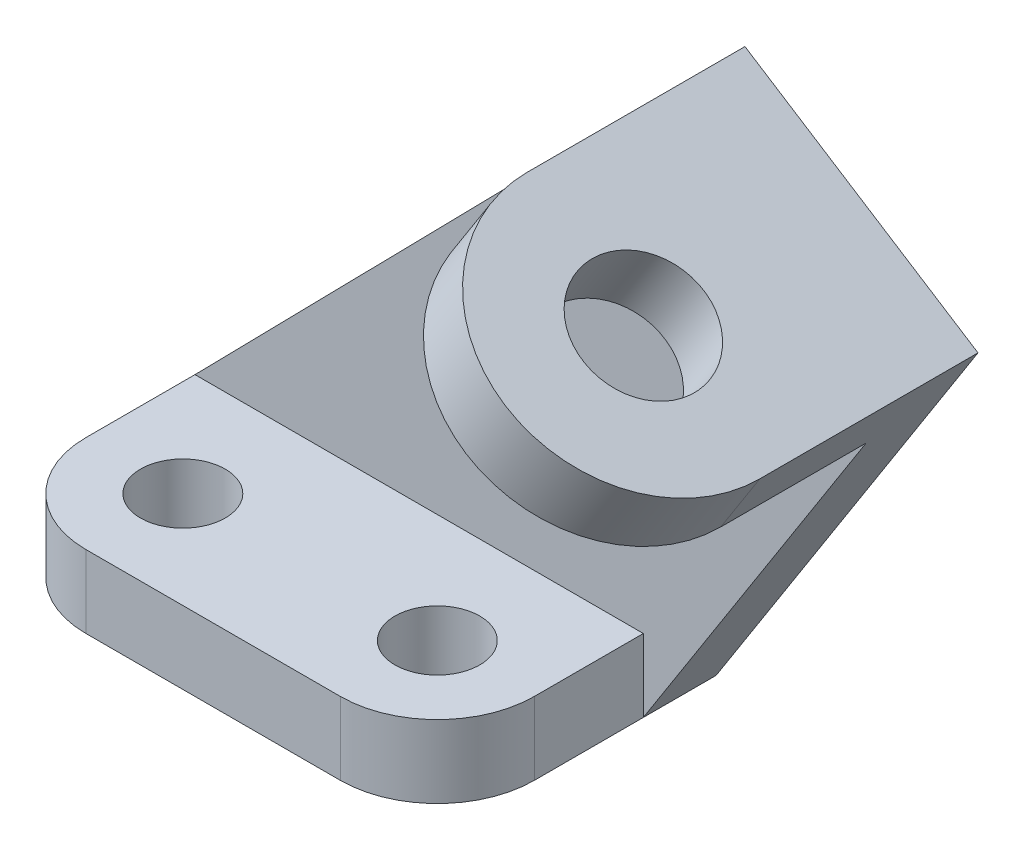
ISO-10303-21;
HEADER;
FILE_DESCRIPTION(('STEP AP214'),'2;1');
FILE_NAME('part.step','',(''),(''),'','','');
FILE_SCHEMA(('AUTOMOTIVE_DESIGN { 1 0 10303 214 1 1 1 1 }'));
ENDSEC;
DATA;
#1=APPLICATION_CONTEXT('core data for automotive mechanical design processes');
#2=APPLICATION_PROTOCOL_DEFINITION('international standard','automotive_design',2000,#1);
#3=PRODUCT_CONTEXT('',#1,'mechanical');
#4=PRODUCT('Part','Part','',(#3));
#5=PRODUCT_RELATED_PRODUCT_CATEGORY('part','',(#4));
#6=PRODUCT_DEFINITION_FORMATION('','',#4);
#7=PRODUCT_DEFINITION_CONTEXT('part definition',#1,'design');
#8=PRODUCT_DEFINITION('design','',#6,#7);
#9=PRODUCT_DEFINITION_SHAPE('','',#8);
#10=(LENGTH_UNIT() NAMED_UNIT(*) SI_UNIT(.MILLI.,.METRE.));
#11=(NAMED_UNIT(*) PLANE_ANGLE_UNIT() SI_UNIT($,.RADIAN.));
#12=(NAMED_UNIT(*) SI_UNIT($,.STERADIAN.) SOLID_ANGLE_UNIT());
#13=UNCERTAINTY_MEASURE_WITH_UNIT(LENGTH_MEASURE(1.E-05),#10,'distance_accuracy_value','');
#14=(GEOMETRIC_REPRESENTATION_CONTEXT(3) GLOBAL_UNCERTAINTY_ASSIGNED_CONTEXT((#13)) GLOBAL_UNIT_ASSIGNED_CONTEXT((#10,
#11,#12)) REPRESENTATION_CONTEXT('',''));
#15=CARTESIAN_POINT('',(0.,0.,0.));
#16=DIRECTION('',(0.,0.,1.));
#17=DIRECTION('',(1.,0.,0.));
#18=AXIS2_PLACEMENT_3D('',#15,#16,#17);
#19=CARTESIAN_POINT('',(16.66875,9.525,23.8125));
#20=DIRECTION('',(0.,-1.,0.));
#21=DIRECTION('',(0.,0.,-1.));
#22=AXIS2_PLACEMENT_3D('',#19,#20,#21);
#23=PLANE('',#22);
#24=CARTESIAN_POINT('',(16.66875,9.525,23.8125));
#25=DIRECTION('',(0.,1.,0.));
#26=DIRECTION('',(0.,0.,-1.));
#27=AXIS2_PLACEMENT_3D('',#24,#25,#26);
#28=CIRCLE('',#27,5.55625);
#29=CARTESIAN_POINT('',(16.66875,9.525,18.25625));
#30=VERTEX_POINT('',#29);
#31=EDGE_CURVE('E184',#30,#30,#28,.T.);
#32=ORIENTED_EDGE('',*,*,#31,.F.);
#33=EDGE_LOOP('',(#32));
#34=FACE_BOUND('',#33,.T.);
#35=CARTESIAN_POINT('',(-16.66875,9.525,23.8125));
#36=DIRECTION('',(0.,1.,0.));
#37=DIRECTION('',(0.,0.,1.));
#38=AXIS2_PLACEMENT_3D('',#35,#36,#37);
#39=CIRCLE('',#38,5.55625);
#40=CARTESIAN_POINT('',(-16.66875,9.525,29.36875));
#41=VERTEX_POINT('',#40);
#42=EDGE_CURVE('E190',#41,#41,#39,.T.);
#43=ORIENTED_EDGE('',*,*,#42,.F.);
#44=EDGE_LOOP('',(#43));
#45=FACE_BOUND('',#44,.T.);
#46=DIRECTION('',(1.,0.,0.));
#47=VECTOR('',#46,1.);
#48=CARTESIAN_POINT('',(16.66875,9.525,9.525));
#49=LINE('',#48,#47);
#50=CARTESIAN_POINT('',(-29.36875,9.525,9.525));
#51=VERTEX_POINT('',#50);
#52=CARTESIAN_POINT('',(29.36875,9.525,9.525));
#53=VERTEX_POINT('',#52);
#54=EDGE_CURVE('E180',#51,#53,#49,.T.);
#55=ORIENTED_EDGE('',*,*,#54,.F.);
#56=DIRECTION('',(0.,0.,1.));
#57=VECTOR('',#56,1.);
#58=CARTESIAN_POINT('',(-29.36875,9.525,0.));
#59=LINE('',#58,#57);
#60=CARTESIAN_POINT('',(-29.36875,9.525,23.8125));
#61=VERTEX_POINT('',#60);
#62=EDGE_CURVE('E202',#51,#61,#59,.T.);
#63=ORIENTED_EDGE('',*,*,#62,.T.);
#64=CARTESIAN_POINT('',(-16.66875,9.525,23.8125));
#65=DIRECTION('',(0.,1.,0.));
#66=DIRECTION('',(0.,0.,1.));
#67=AXIS2_PLACEMENT_3D('',#64,#65,#66);
#68=CIRCLE('',#67,12.7);
#69=CARTESIAN_POINT('',(-16.66875,9.525,36.5125));
#70=VERTEX_POINT('',#69);
#71=EDGE_CURVE('E206',#61,#70,#68,.T.);
#72=ORIENTED_EDGE('',*,*,#71,.T.);
#73=DIRECTION('',(1.,0.,0.));
#74=VECTOR('',#73,1.);
#75=CARTESIAN_POINT('',(-16.66875,9.525,36.5125));
#76=LINE('',#75,#74);
#77=CARTESIAN_POINT('',(16.66875,9.525,36.5125));
#78=VERTEX_POINT('',#77);
#79=EDGE_CURVE('E208',#70,#78,#76,.T.);
#80=ORIENTED_EDGE('',*,*,#79,.T.);
#81=CARTESIAN_POINT('',(16.66875,9.525,23.8125));
#82=DIRECTION('',(0.,1.,0.));
#83=DIRECTION('',(0.,0.,-1.));
#84=AXIS2_PLACEMENT_3D('',#81,#82,#83);
#85=CIRCLE('',#84,12.7);
#86=CARTESIAN_POINT('',(29.36875,9.525,23.8125));
#87=VERTEX_POINT('',#86);
#88=EDGE_CURVE('E196',#78,#87,#85,.T.);
#89=ORIENTED_EDGE('',*,*,#88,.T.);
#90=DIRECTION('',(0.,0.,-1.));
#91=VECTOR('',#90,1.);
#92=CARTESIAN_POINT('',(29.36875,9.525,23.8125));
#93=LINE('',#92,#91);
#94=EDGE_CURVE('E199',#87,#53,#93,.T.);
#95=ORIENTED_EDGE('',*,*,#94,.T.);
#96=EDGE_LOOP('',(#55,#63,#72,#80,#89,#95));
#97=FACE_BOUND('',#96,.T.);
#98=ADVANCED_FACE('F35',(#34,#45,#97),#23,.F.);
#99=CARTESIAN_POINT('',(29.36875,9.525,23.8125));
#100=DIRECTION('',(-1.,0.,0.));
#101=DIRECTION('',(0.,0.,1.));
#102=AXIS2_PLACEMENT_3D('',#99,#100,#101);
#103=PLANE('',#102);
#104=DIRECTION('',(0.,-1.,0.));
#105=VECTOR('',#104,1.);
#106=CARTESIAN_POINT('',(29.36875,9.525,9.525));
#107=LINE('',#106,#105);
#108=CARTESIAN_POINT('',(29.36875,0.,9.525));
#109=VERTEX_POINT('',#108);
#110=EDGE_CURVE('E50',#53,#109,#107,.T.);
#111=ORIENTED_EDGE('',*,*,#110,.F.);
#112=ORIENTED_EDGE('',*,*,#94,.F.);
#113=DIRECTION('',(0.,-1.,0.));
#114=VECTOR('',#113,1.);
#115=CARTESIAN_POINT('',(29.36875,9.525,23.8125));
#116=LINE('',#115,#114);
#117=CARTESIAN_POINT('',(29.36875,0.,23.8125));
#118=VERTEX_POINT('',#117);
#119=EDGE_CURVE('E11',#87,#118,#116,.T.);
#120=ORIENTED_EDGE('',*,*,#119,.T.);
#121=DIRECTION('',(0.,0.,-1.));
#122=VECTOR('',#121,1.);
#123=CARTESIAN_POINT('',(29.36875,0.,23.8125));
#124=LINE('',#123,#122);
#125=EDGE_CURVE('E213',#118,#109,#124,.T.);
#126=ORIENTED_EDGE('',*,*,#125,.T.);
#127=EDGE_LOOP('',(#111,#112,#120,#126));
#128=FACE_BOUND('',#127,.T.);
#129=ADVANCED_FACE('F277',(#128),#103,.F.);
#130=CARTESIAN_POINT('',(16.66875,0.,23.8125));
#131=DIRECTION('',(0.,-1.,0.));
#132=DIRECTION('',(0.,0.,-1.));
#133=AXIS2_PLACEMENT_3D('',#130,#131,#132);
#134=PLANE('',#133);
#135=DIRECTION('',(0.,0.,-1.));
#136=VECTOR('',#135,1.);
#137=CARTESIAN_POINT('',(29.36875,0.,9.525));
#138=LINE('',#137,#136);
#139=CARTESIAN_POINT('',(29.36875,0.,0.));
#140=VERTEX_POINT('',#139);
#141=EDGE_CURVE('E174',#109,#140,#138,.T.);
#142=ORIENTED_EDGE('',*,*,#141,.F.);
#143=ORIENTED_EDGE('',*,*,#125,.F.);
#144=CARTESIAN_POINT('',(16.66875,0.,23.8125));
#145=DIRECTION('',(0.,1.,0.));
#146=DIRECTION('',(0.,0.,-1.));
#147=AXIS2_PLACEMENT_3D('',#144,#145,#146);
#148=CIRCLE('',#147,12.7);
#149=CARTESIAN_POINT('',(16.66875,0.,36.5125));
#150=VERTEX_POINT('',#149);
#151=EDGE_CURVE('E193',#150,#118,#148,.T.);
#152=ORIENTED_EDGE('',*,*,#151,.F.);
#153=DIRECTION('',(1.,0.,0.));
#154=VECTOR('',#153,1.);
#155=CARTESIAN_POINT('',(-16.66875,0.,36.5125));
#156=LINE('',#155,#154);
#157=CARTESIAN_POINT('',(-16.66875,0.,36.5125));
#158=VERTEX_POINT('',#157);
#159=EDGE_CURVE('E200',#158,#150,#156,.T.);
#160=ORIENTED_EDGE('',*,*,#159,.F.);
#161=CARTESIAN_POINT('',(-16.66875,0.,23.8125));
#162=DIRECTION('',(0.,1.,0.));
#163=DIRECTION('',(0.,0.,1.));
#164=AXIS2_PLACEMENT_3D('',#161,#162,#163);
#165=CIRCLE('',#164,12.7);
#166=CARTESIAN_POINT('',(-29.36875,0.,23.8125));
#167=VERTEX_POINT('',#166);
#168=EDGE_CURVE('E219',#167,#158,#165,.T.);
#169=ORIENTED_EDGE('',*,*,#168,.F.);
#170=DIRECTION('',(0.,0.,1.));
#171=VECTOR('',#170,1.);
#172=CARTESIAN_POINT('',(-29.36875,0.,0.));
#173=LINE('',#172,#171);
#174=CARTESIAN_POINT('',(-29.36875,0.,0.));
#175=VERTEX_POINT('',#174);
#176=EDGE_CURVE('E217',#175,#167,#173,.T.);
#177=ORIENTED_EDGE('',*,*,#176,.F.);
#178=DIRECTION('',(-1.,0.,0.));
#179=VECTOR('',#178,1.);
#180=CARTESIAN_POINT('',(29.36875,0.,0.));
#181=LINE('',#180,#179);
#182=EDGE_CURVE('E215',#140,#175,#181,.T.);
#183=ORIENTED_EDGE('',*,*,#182,.F.);
#184=EDGE_LOOP('',(#142,#143,#152,#160,#169,#177,#183));
#185=FACE_BOUND('',#184,.T.);
#186=CARTESIAN_POINT('',(-16.66875,0.,23.8125));
#187=DIRECTION('',(0.,1.,0.));
#188=DIRECTION('',(0.,0.,1.));
#189=AXIS2_PLACEMENT_3D('',#186,#187,#188);
#190=CIRCLE('',#189,5.55625);
#191=CARTESIAN_POINT('',(-16.66875,0.,29.36875));
#192=VERTEX_POINT('',#191);
#193=EDGE_CURVE('E187',#192,#192,#190,.T.);
#194=ORIENTED_EDGE('',*,*,#193,.T.);
#195=EDGE_LOOP('',(#194));
#196=FACE_BOUND('',#195,.T.);
#197=CARTESIAN_POINT('',(16.66875,0.,23.8125));
#198=DIRECTION('',(0.,1.,0.));
#199=DIRECTION('',(0.,0.,-1.));
#200=AXIS2_PLACEMENT_3D('',#197,#198,#199);
#201=CIRCLE('',#200,5.55625);
#202=CARTESIAN_POINT('',(16.66875,0.,18.25625));
#203=VERTEX_POINT('',#202);
#204=EDGE_CURVE('E183',#203,#203,#201,.T.);
#205=ORIENTED_EDGE('',*,*,#204,.T.);
#206=EDGE_LOOP('',(#205));
#207=FACE_BOUND('',#206,.T.);
#208=ADVANCED_FACE('F240',(#185,#196,#207),#134,.T.);
#209=CARTESIAN_POINT('',(16.66875,9.525,23.8125));
#210=DIRECTION('',(0.,-1.,0.));
#211=DIRECTION('',(0.,0.,-1.));
#212=AXIS2_PLACEMENT_3D('',#209,#210,#211);
#213=CYLINDRICAL_SURFACE('',#212,12.7);
#214=ORIENTED_EDGE('',*,*,#151,.T.);
#215=ORIENTED_EDGE('',*,*,#119,.F.);
#216=ORIENTED_EDGE('',*,*,#88,.F.);
#217=DIRECTION('',(0.,-1.,0.));
#218=VECTOR('',#217,1.);
#219=CARTESIAN_POINT('',(16.66875,9.525,36.5125));
#220=LINE('',#219,#218);
#221=EDGE_CURVE('E210',#78,#150,#220,.T.);
#222=ORIENTED_EDGE('',*,*,#221,.T.);
#223=EDGE_LOOP('',(#214,#215,#216,#222));
#224=FACE_BOUND('',#223,.T.);
#225=ADVANCED_FACE('F37',(#224),#213,.T.);
#226=CARTESIAN_POINT('',(29.36875,9.525,0.));
#227=DIRECTION('',(0.,0.,1.));
#228=DIRECTION('',(1.,0.,0.));
#229=AXIS2_PLACEMENT_3D('',#226,#227,#228);
#230=PLANE('',#229);
#231=DIRECTION('',(0.700383819222111,0.713766422418321,0.));
#232=VECTOR('',#231,1.);
#233=CARTESIAN_POINT('',(33.1548239619886,73.2432448806736,0.));
#234=LINE('',#233,#232);
#235=CARTESIAN_POINT('',(-29.36875,9.525,0.));
#236=VERTEX_POINT('',#235);
#237=CARTESIAN_POINT('',(33.1548239619886,73.2432448806736,0.));
#238=VERTEX_POINT('',#237);
#239=EDGE_CURVE('E161',#236,#238,#234,.T.);
#240=ORIENTED_EDGE('',*,*,#239,.T.);
#241=DIRECTION('',(0.842914361308564,-0.538047748345605,0.));
#242=VECTOR('',#241,1.);
#243=CARTESIAN_POINT('',(63.6826760380114,53.7567551193265,0.));
#244=LINE('',#243,#242);
#245=CARTESIAN_POINT('',(63.6826760380114,53.7567551193265,0.));
#246=VERTEX_POINT('',#245);
#247=EDGE_CURVE('E170',#238,#246,#244,.T.);
#248=ORIENTED_EDGE('',*,*,#247,.T.);
#249=DIRECTION('',(-0.538047748345605,-0.842914361308564,0.));
#250=VECTOR('',#249,1.);
#251=CARTESIAN_POINT('',(29.36875,0.,0.));
#252=LINE('',#251,#250);
#253=EDGE_CURVE('E165',#246,#140,#252,.T.);
#254=ORIENTED_EDGE('',*,*,#253,.T.);
#255=ORIENTED_EDGE('',*,*,#182,.T.);
#256=DIRECTION('',(0.,-1.,0.));
#257=VECTOR('',#256,1.);
#258=CARTESIAN_POINT('',(-29.36875,9.525,0.));
#259=LINE('',#258,#257);
#260=EDGE_CURVE('E43',#236,#175,#259,.T.);
#261=ORIENTED_EDGE('',*,*,#260,.F.);
#262=EDGE_LOOP('',(#240,#248,#254,#255,#261));
#263=FACE_BOUND('',#262,.T.);
#264=ADVANCED_FACE('F267',(#263),#230,.F.);
#265=CARTESIAN_POINT('',(-29.36875,9.525,0.));
#266=DIRECTION('',(1.,0.,0.));
#267=DIRECTION('',(0.,0.,-1.));
#268=AXIS2_PLACEMENT_3D('',#265,#266,#267);
#269=PLANE('',#268);
#270=ORIENTED_EDGE('',*,*,#176,.T.);
#271=DIRECTION('',(0.,-1.,0.));
#272=VECTOR('',#271,1.);
#273=CARTESIAN_POINT('',(-29.36875,9.525,23.8125));
#274=LINE('',#273,#272);
#275=EDGE_CURVE('E227',#61,#167,#274,.T.);
#276=ORIENTED_EDGE('',*,*,#275,.F.);
#277=ORIENTED_EDGE('',*,*,#62,.F.);
#278=EDGE_CURVE('E203',#236,#51,#59,.T.);
#279=ORIENTED_EDGE('',*,*,#278,.F.);
#280=ORIENTED_EDGE('',*,*,#260,.T.);
#281=EDGE_LOOP('',(#270,#276,#277,#279,#280));
#282=FACE_BOUND('',#281,.T.);
#283=ADVANCED_FACE('F233',(#282),#269,.F.);
#284=CARTESIAN_POINT('',(-16.66875,9.525,23.8125));
#285=DIRECTION('',(0.,-1.,0.));
#286=DIRECTION('',(0.,0.,-1.));
#287=AXIS2_PLACEMENT_3D('',#284,#285,#286);
#288=CYLINDRICAL_SURFACE('',#287,12.7);
#289=ORIENTED_EDGE('',*,*,#168,.T.);
#290=DIRECTION('',(0.,-1.,0.));
#291=VECTOR('',#290,1.);
#292=CARTESIAN_POINT('',(-16.66875,9.525,36.5125));
#293=LINE('',#292,#291);
#294=EDGE_CURVE('E224',#70,#158,#293,.T.);
#295=ORIENTED_EDGE('',*,*,#294,.F.);
#296=ORIENTED_EDGE('',*,*,#71,.F.);
#297=ORIENTED_EDGE('',*,*,#275,.T.);
#298=EDGE_LOOP('',(#289,#295,#296,#297));
#299=FACE_BOUND('',#298,.T.);
#300=ADVANCED_FACE('F246',(#299),#288,.T.);
#301=CARTESIAN_POINT('',(-16.66875,9.525,36.5125));
#302=DIRECTION('',(0.,0.,-1.));
#303=DIRECTION('',(-1.,0.,0.));
#304=AXIS2_PLACEMENT_3D('',#301,#302,#303);
#305=PLANE('',#304);
#306=ORIENTED_EDGE('',*,*,#159,.T.);
#307=ORIENTED_EDGE('',*,*,#221,.F.);
#308=ORIENTED_EDGE('',*,*,#79,.F.);
#309=ORIENTED_EDGE('',*,*,#294,.T.);
#310=EDGE_LOOP('',(#306,#307,#308,#309));
#311=FACE_BOUND('',#310,.T.);
#312=ADVANCED_FACE('F250',(#311),#305,.F.);
#313=CARTESIAN_POINT('',(-16.66875,9.525,23.8125));
#314=DIRECTION('',(0.,-1.,0.));
#315=DIRECTION('',(0.,0.,-1.));
#316=AXIS2_PLACEMENT_3D('',#313,#314,#315);
#317=CYLINDRICAL_SURFACE('',#316,5.55625);
#318=ORIENTED_EDGE('',*,*,#42,.T.);
#319=EDGE_LOOP('',(#318));
#320=FACE_BOUND('',#319,.T.);
#321=ORIENTED_EDGE('',*,*,#193,.F.);
#322=EDGE_LOOP('',(#321));
#323=FACE_BOUND('',#322,.T.);
#324=ADVANCED_FACE('F287',(#320,#323),#317,.F.);
#325=CARTESIAN_POINT('',(16.66875,9.525,23.8125));
#326=DIRECTION('',(0.,-1.,0.));
#327=DIRECTION('',(0.,0.,-1.));
#328=AXIS2_PLACEMENT_3D('',#325,#326,#327);
#329=CYLINDRICAL_SURFACE('',#328,5.55625);
#330=ORIENTED_EDGE('',*,*,#31,.T.);
#331=EDGE_LOOP('',(#330));
#332=FACE_BOUND('',#331,.T.);
#333=ORIENTED_EDGE('',*,*,#204,.F.);
#334=EDGE_LOOP('',(#333));
#335=FACE_BOUND('',#334,.T.);
#336=ADVANCED_FACE('F309',(#332,#335),#329,.F.);
#337=CARTESIAN_POINT('',(0.,0.,9.525));
#338=DIRECTION('',(0.,0.,-1.));
#339=DIRECTION('',(-1.,0.,0.));
#340=AXIS2_PLACEMENT_3D('',#337,#338,#339);
#341=PLANE('',#340);
#342=DIRECTION('',(0.842914361308564,-0.538047748345605,0.));
#343=VECTOR('',#342,1.);
#344=CARTESIAN_POINT('',(37.6911386617036,59.0475513924375,9.525));
#345=LINE('',#344,#343);
#346=CARTESIAN_POINT('',(28.0299191589967,65.2144855892095,9.525));
#347=VERTEX_POINT('',#346);
#348=CARTESIAN_POINT('',(58.5577712350195,45.7279958278624,9.525));
#349=VERTEX_POINT('',#348);
#350=EDGE_CURVE('E159',#347,#349,#345,.T.);
#351=ORIENTED_EDGE('',*,*,#350,.F.);
#352=DIRECTION('',(0.538047748345605,0.842914361308564,0.));
#353=VECTOR('',#352,1.);
#354=CARTESIAN_POINT('',(-9.66121950270681,6.16693419677204,9.525));
#355=LINE('',#354,#353);
#356=CARTESIAN_POINT('',(33.1548239619886,73.2432448806736,9.525));
#357=VERTEX_POINT('',#356);
#358=EDGE_CURVE('E130',#347,#357,#355,.T.);
#359=ORIENTED_EDGE('',*,*,#358,.T.);
#360=DIRECTION('',(0.700383819222111,0.713766422418321,0.));
#361=VECTOR('',#360,1.);
#362=CARTESIAN_POINT('',(33.1548239619886,73.2432448806736,9.525));
#363=LINE('',#362,#361);
#364=EDGE_CURVE('E162',#51,#357,#363,.T.);
#365=ORIENTED_EDGE('',*,*,#364,.F.);
#366=ORIENTED_EDGE('',*,*,#54,.T.);
#367=ORIENTED_EDGE('',*,*,#110,.T.);
#368=DIRECTION('',(-0.538047748345605,-0.842914361308564,0.));
#369=VECTOR('',#368,1.);
#370=CARTESIAN_POINT('',(29.36875,0.,9.525));
#371=LINE('',#370,#369);
#372=EDGE_CURVE('E58',#349,#109,#371,.T.);
#373=ORIENTED_EDGE('',*,*,#372,.F.);
#374=EDGE_LOOP('',(#351,#359,#365,#366,#367,#373));
#375=FACE_BOUND('',#374,.T.);
#376=ADVANCED_FACE('F260',(#375),#341,.F.);
#377=CARTESIAN_POINT('',(29.36875,0.,9.525));
#378=DIRECTION('',(0.842914361308564,-0.538047748345605,0.));
#379=DIRECTION('',(0.538047748345605,0.842914361308564,0.));
#380=AXIS2_PLACEMENT_3D('',#377,#378,#379);
#381=PLANE('',#380);
#382=DIRECTION('',(0.,0.,-1.));
#383=VECTOR('',#382,1.);
#384=CARTESIAN_POINT('',(63.6826760380114,53.7567551193265,9.52499999999999));
#385=LINE('',#384,#383);
#386=CARTESIAN_POINT('',(63.6826760380114,53.7567551193265,28.575));
#387=VERTEX_POINT('',#386);
#388=EDGE_CURVE('E176',#387,#246,#385,.T.);
#389=ORIENTED_EDGE('',*,*,#388,.F.);
#390=DIRECTION('',(0.538047748345605,0.842914361308564,0.));
#391=VECTOR('',#390,1.);
#392=CARTESIAN_POINT('',(58.5577712350195,45.7279958278624,28.575));
#393=LINE('',#392,#391);
#394=CARTESIAN_POINT('',(58.5577712350195,45.7279958278624,28.575));
#395=VERTEX_POINT('',#394);
#396=EDGE_CURVE('E143',#395,#387,#393,.T.);
#397=ORIENTED_EDGE('',*,*,#396,.F.);
#398=DIRECTION('',(0.,0.,-1.));
#399=VECTOR('',#398,1.);
#400=CARTESIAN_POINT('',(58.5577712350195,45.7279958278624,0.));
#401=LINE('',#400,#399);
#402=EDGE_CURVE('E135',#395,#349,#401,.T.);
#403=ORIENTED_EDGE('',*,*,#402,.T.);
#404=ORIENTED_EDGE('',*,*,#372,.T.);
#405=ORIENTED_EDGE('',*,*,#141,.T.);
#406=ORIENTED_EDGE('',*,*,#253,.F.);
#407=EDGE_LOOP('',(#389,#397,#403,#404,#405,#406));
#408=FACE_BOUND('',#407,.T.);
#409=ADVANCED_FACE('F322',(#408),#381,.T.);
#410=CARTESIAN_POINT('',(63.6826760380114,53.7567551193265,9.52499999999999));
#411=DIRECTION('',(0.538047748345605,0.842914361308564,0.));
#412=DIRECTION('',(-0.842914361308564,0.538047748345605,0.));
#413=AXIS2_PLACEMENT_3D('',#410,#411,#412);
#414=PLANE('',#413);
#415=ORIENTED_EDGE('',*,*,#247,.F.);
#416=DIRECTION('',(0.,0.,-1.));
#417=VECTOR('',#416,1.);
#418=CARTESIAN_POINT('',(33.1548239619886,73.2432448806736,9.525));
#419=LINE('',#418,#417);
#420=EDGE_CURVE('E167',#357,#238,#419,.T.);
#421=ORIENTED_EDGE('',*,*,#420,.F.);
#422=DIRECTION('',(0.,0.,1.));
#423=VECTOR('',#422,1.);
#424=CARTESIAN_POINT('',(33.1548239619886,73.2432448806736,0.));
#425=LINE('',#424,#423);
#426=CARTESIAN_POINT('',(33.1548239619886,73.2432448806736,28.575));
#427=VERTEX_POINT('',#426);
#428=EDGE_CURVE('E153',#357,#427,#425,.T.);
#429=ORIENTED_EDGE('',*,*,#428,.T.);
#430=CARTESIAN_POINT('',(48.41875,63.5,28.575));
#431=DIRECTION('',(0.538047748345605,0.842914361308564,0.));
#432=DIRECTION('',(-0.842914361308564,0.538047748345605,0.));
#433=AXIS2_PLACEMENT_3D('',#430,#431,#432);
#434=CIRCLE('',#433,18.1085134370178);
#435=EDGE_CURVE('E142',#427,#387,#434,.T.);
#436=ORIENTED_EDGE('',*,*,#435,.T.);
#437=ORIENTED_EDGE('',*,*,#388,.T.);
#438=EDGE_LOOP('',(#415,#421,#429,#436,#437));
#439=FACE_BOUND('',#438,.T.);
#440=CARTESIAN_POINT('',(48.41875,63.5,28.575));
#441=DIRECTION('',(0.538047748345605,0.842914361308564,0.));
#442=DIRECTION('',(-0.842914361308564,0.538047748345605,0.));
#443=AXIS2_PLACEMENT_3D('',#440,#441,#442);
#444=CIRCLE('',#443,7.9375);
#445=CARTESIAN_POINT('',(41.7281172571133,67.7707540024933,28.575));
#446=VERTEX_POINT('',#445);
#447=EDGE_CURVE('E150',#446,#446,#444,.T.);
#448=ORIENTED_EDGE('',*,*,#447,.F.);
#449=EDGE_LOOP('',(#448));
#450=FACE_BOUND('',#449,.T.);
#451=ADVANCED_FACE('F264',(#439,#450),#414,.T.);
#452=CARTESIAN_POINT('',(33.1548239619886,73.2432448806736,9.525));
#453=DIRECTION('',(-0.713766422418321,0.700383819222111,0.));
#454=DIRECTION('',(-0.700383819222111,-0.713766422418321,0.));
#455=AXIS2_PLACEMENT_3D('',#452,#453,#454);
#456=PLANE('',#455);
#457=ORIENTED_EDGE('',*,*,#239,.F.);
#458=ORIENTED_EDGE('',*,*,#278,.T.);
#459=ORIENTED_EDGE('',*,*,#364,.T.);
#460=ORIENTED_EDGE('',*,*,#420,.T.);
#461=EDGE_LOOP('',(#457,#458,#459,#460));
#462=FACE_BOUND('',#461,.T.);
#463=ADVANCED_FACE('F259',(#462),#456,.T.);
#464=CARTESIAN_POINT('',(37.6911386617036,59.0475513924375,0.));
#465=DIRECTION('',(0.538047748345605,0.842914361308564,0.));
#466=DIRECTION('',(-0.842914361308564,0.538047748345605,0.));
#467=AXIS2_PLACEMENT_3D('',#464,#465,#466);
#468=PLANE('',#467);
#469=CARTESIAN_POINT('',(43.2938451970081,55.471240708536,28.575));
#470=DIRECTION('',(0.538047748345605,0.842914361308564,0.));
#471=DIRECTION('',(-0.842914361308564,0.538047748345605,0.));
#472=AXIS2_PLACEMENT_3D('',#469,#470,#471);
#473=CIRCLE('',#472,7.9375);
#474=CARTESIAN_POINT('',(36.6032124541214,59.7419947110292,28.575));
#475=VERTEX_POINT('',#474);
#476=EDGE_CURVE('E156',#475,#475,#473,.T.);
#477=ORIENTED_EDGE('',*,*,#476,.T.);
#478=EDGE_LOOP('',(#477));
#479=FACE_BOUND('',#478,.T.);
#480=DIRECTION('',(0.,0.,1.));
#481=VECTOR('',#480,1.);
#482=CARTESIAN_POINT('',(28.0299191589967,65.2144855892095,0.));
#483=LINE('',#482,#481);
#484=CARTESIAN_POINT('',(28.0299191589967,65.2144855892095,28.575));
#485=VERTEX_POINT('',#484);
#486=EDGE_CURVE('E124',#347,#485,#483,.T.);
#487=ORIENTED_EDGE('',*,*,#486,.F.);
#488=ORIENTED_EDGE('',*,*,#350,.T.);
#489=ORIENTED_EDGE('',*,*,#402,.F.);
#490=CARTESIAN_POINT('',(43.2938451970081,55.471240708536,28.575));
#491=DIRECTION('',(0.538047748345605,0.842914361308564,0.));
#492=DIRECTION('',(-0.842914361308564,0.538047748345605,0.));
#493=AXIS2_PLACEMENT_3D('',#490,#491,#492);
#494=CIRCLE('',#493,18.1085134370178);
#495=EDGE_CURVE('E134',#485,#395,#494,.T.);
#496=ORIENTED_EDGE('',*,*,#495,.F.);
#497=EDGE_LOOP('',(#487,#488,#489,#496));
#498=FACE_BOUND('',#497,.T.);
#499=ADVANCED_FACE('F146',(#479,#498),#468,.F.);
#500=CARTESIAN_POINT('',(28.0299191589967,65.2144855892095,0.));
#501=DIRECTION('',(-0.842914361308564,0.538047748345605,0.));
#502=DIRECTION('',(-0.538047748345605,-0.842914361308564,0.));
#503=AXIS2_PLACEMENT_3D('',#500,#501,#502);
#504=PLANE('',#503);
#505=ORIENTED_EDGE('',*,*,#358,.F.);
#506=ORIENTED_EDGE('',*,*,#486,.T.);
#507=DIRECTION('',(0.538047748345605,0.842914361308564,0.));
#508=VECTOR('',#507,1.);
#509=CARTESIAN_POINT('',(28.0299191589967,65.2144855892095,28.575));
#510=LINE('',#509,#508);
#511=EDGE_CURVE('E127',#485,#427,#510,.T.);
#512=ORIENTED_EDGE('',*,*,#511,.T.);
#513=ORIENTED_EDGE('',*,*,#428,.F.);
#514=EDGE_LOOP('',(#505,#506,#512,#513));
#515=FACE_BOUND('',#514,.T.);
#516=ADVANCED_FACE('F126',(#515),#504,.T.);
#517=CARTESIAN_POINT('',(43.2938451970081,55.471240708536,28.575));
#518=DIRECTION('',(0.538047748345605,0.842914361308564,0.));
#519=DIRECTION('',(-0.842914361308564,0.538047748345605,0.));
#520=AXIS2_PLACEMENT_3D('',#517,#518,#519);
#521=CYLINDRICAL_SURFACE('',#520,18.1085134370178);
#522=ORIENTED_EDGE('',*,*,#435,.F.);
#523=ORIENTED_EDGE('',*,*,#511,.F.);
#524=ORIENTED_EDGE('',*,*,#495,.T.);
#525=ORIENTED_EDGE('',*,*,#396,.T.);
#526=EDGE_LOOP('',(#522,#523,#524,#525));
#527=FACE_BOUND('',#526,.T.);
#528=ADVANCED_FACE('F139',(#527),#521,.T.);
#529=CARTESIAN_POINT('',(43.2938451970081,55.471240708536,28.575));
#530=DIRECTION('',(0.538047748345605,0.842914361308564,0.));
#531=DIRECTION('',(-0.842914361308564,0.538047748345605,0.));
#532=AXIS2_PLACEMENT_3D('',#529,#530,#531);
#533=CYLINDRICAL_SURFACE('',#532,7.9375);
#534=ORIENTED_EDGE('',*,*,#476,.F.);
#535=EDGE_LOOP('',(#534));
#536=FACE_BOUND('',#535,.T.);
#537=ORIENTED_EDGE('',*,*,#447,.T.);
#538=EDGE_LOOP('',(#537));
#539=FACE_BOUND('',#538,.T.);
#540=ADVANCED_FACE('F360',(#536,#539),#533,.F.);
#541=CLOSED_SHELL('',(#98,#129,#208,#225,#264,#283,#300,#312,#324,#336,#376,#409,#451,#463,#499,
#516,#528,#540));
#542=MANIFOLD_SOLID_BREP('B2',#541);
#543=ADVANCED_BREP_SHAPE_REPRESENTATION('',(#18,#542),#14);
#544=SHAPE_DEFINITION_REPRESENTATION(#9,#543);
ENDSEC;
END-ISO-10303-21;
